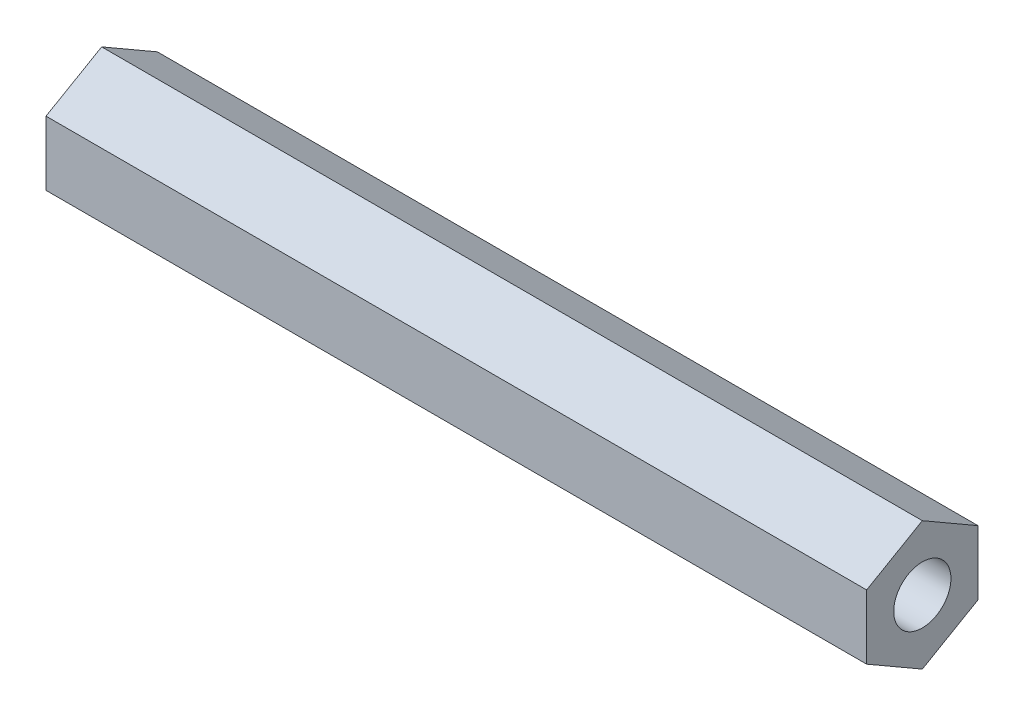
ISO-10303-21;
HEADER;
FILE_DESCRIPTION(('STEP AP214'),'2;1');
FILE_NAME('part.step','',(''),(''),'','','');
FILE_SCHEMA(('AUTOMOTIVE_DESIGN { 1 0 10303 214 1 1 1 1 }'));
ENDSEC;
DATA;
#1=APPLICATION_CONTEXT('core data for automotive mechanical design processes');
#2=APPLICATION_PROTOCOL_DEFINITION('international standard','automotive_design',2000,#1);
#3=PRODUCT_CONTEXT('',#1,'mechanical');
#4=PRODUCT('Part','Part','',(#3));
#5=PRODUCT_RELATED_PRODUCT_CATEGORY('part','',(#4));
#6=PRODUCT_DEFINITION_FORMATION('','',#4);
#7=PRODUCT_DEFINITION_CONTEXT('part definition',#1,'design');
#8=PRODUCT_DEFINITION('design','',#6,#7);
#9=PRODUCT_DEFINITION_SHAPE('','',#8);
#10=(LENGTH_UNIT() NAMED_UNIT(*) SI_UNIT(.MILLI.,.METRE.));
#11=(NAMED_UNIT(*) PLANE_ANGLE_UNIT() SI_UNIT($,.RADIAN.));
#12=(NAMED_UNIT(*) SI_UNIT($,.STERADIAN.) SOLID_ANGLE_UNIT());
#13=UNCERTAINTY_MEASURE_WITH_UNIT(LENGTH_MEASURE(1.E-05),#10,'distance_accuracy_value','');
#14=(GEOMETRIC_REPRESENTATION_CONTEXT(3) GLOBAL_UNCERTAINTY_ASSIGNED_CONTEXT((#13)) GLOBAL_UNIT_ASSIGNED_CONTEXT((#10,
#11,#12)) REPRESENTATION_CONTEXT('',''));
#15=CARTESIAN_POINT('',(0.,0.,0.));
#16=DIRECTION('',(0.,0.,1.));
#17=DIRECTION('',(1.,0.,0.));
#18=AXIS2_PLACEMENT_3D('',#15,#16,#17);
#19=CARTESIAN_POINT('',(93.599,0.,0.));
#20=DIRECTION('',(1.,0.,0.));
#21=DIRECTION('',(0.,0.,-1.));
#22=AXIS2_PLACEMENT_3D('',#19,#20,#21);
#23=PLANE('',#22);
#24=DIRECTION('',(0.,0.499999999999995,0.866025403784442));
#25=VECTOR('',#24,1.);
#26=CARTESIAN_POINT('',(93.599,3.66617420935419,-6.34999999999995));
#27=LINE('',#26,#25);
#28=CARTESIAN_POINT('',(93.599,3.66617420935419,-6.34999999999995));
#29=VERTEX_POINT('',#28);
#30=CARTESIAN_POINT('',(93.599,7.33234841870824,0.));
#31=VERTEX_POINT('',#30);
#32=EDGE_CURVE('E146',#29,#31,#27,.T.);
#33=ORIENTED_EDGE('',*,*,#32,.T.);
#34=DIRECTION('',(0.,-0.500000000000001,0.866025403784438));
#35=VECTOR('',#34,1.);
#36=CARTESIAN_POINT('',(93.599,7.33234841870824,0.));
#37=LINE('',#36,#35);
#38=CARTESIAN_POINT('',(93.599,3.6661742093541,6.35));
#39=VERTEX_POINT('',#38);
#40=EDGE_CURVE('E94',#31,#39,#37,.T.);
#41=ORIENTED_EDGE('',*,*,#40,.T.);
#42=DIRECTION('',(0.,-1.,0.));
#43=VECTOR('',#42,1.);
#44=CARTESIAN_POINT('',(93.599,3.6661742093541,6.35));
#45=LINE('',#44,#43);
#46=CARTESIAN_POINT('',(93.599,-3.66617420935415,6.34999999999997));
#47=VERTEX_POINT('',#46);
#48=EDGE_CURVE('E107',#39,#47,#45,.T.);
#49=ORIENTED_EDGE('',*,*,#48,.T.);
#50=DIRECTION('',(0.,-0.499999999999995,-0.866025403784442));
#51=VECTOR('',#50,1.);
#52=CARTESIAN_POINT('',(93.599,-3.66617420935415,6.34999999999997));
#53=LINE('',#52,#51);
#54=CARTESIAN_POINT('',(93.599,-7.33234841870824,0.));
#55=VERTEX_POINT('',#54);
#56=EDGE_CURVE('E101',#47,#55,#53,.T.);
#57=ORIENTED_EDGE('',*,*,#56,.T.);
#58=DIRECTION('',(0.,0.500000000000007,-0.866025403784435));
#59=VECTOR('',#58,1.);
#60=CARTESIAN_POINT('',(93.599,-7.33234841870824,0.));
#61=LINE('',#60,#59);
#62=CARTESIAN_POINT('',(93.599,-3.66617420935406,-6.35000000000002));
#63=VERTEX_POINT('',#62);
#64=EDGE_CURVE('E105',#55,#63,#61,.T.);
#65=ORIENTED_EDGE('',*,*,#64,.T.);
#66=DIRECTION('',(0.,1.,0.));
#67=VECTOR('',#66,1.);
#68=CARTESIAN_POINT('',(93.599,-3.66617420935406,-6.35000000000002));
#69=LINE('',#68,#67);
#70=EDGE_CURVE('E57',#63,#29,#69,.T.);
#71=ORIENTED_EDGE('',*,*,#70,.T.);
#72=EDGE_LOOP('',(#33,#41,#49,#57,#65,#71));
#73=FACE_BOUND('',#72,.T.);
#74=CARTESIAN_POINT('',(93.599,0.,0.));
#75=DIRECTION('',(1.,0.,0.));
#76=DIRECTION('',(0.,0.,-1.));
#77=AXIS2_PLACEMENT_3D('',#74,#75,#76);
#78=CIRCLE('',#77,3.2639);
#79=CARTESIAN_POINT('',(93.599,0.,-3.2639));
#80=VERTEX_POINT('',#79);
#81=EDGE_CURVE('E134',#80,#80,#78,.T.);
#82=ORIENTED_EDGE('',*,*,#81,.F.);
#83=EDGE_LOOP('',(#82));
#84=FACE_BOUND('',#83,.T.);
#85=ADVANCED_FACE('F39',(#73,#84),#23,.T.);
#86=CARTESIAN_POINT('',(0.,0.,0.));
#87=DIRECTION('',(1.,0.,0.));
#88=DIRECTION('',(0.,0.,-1.));
#89=AXIS2_PLACEMENT_3D('',#86,#87,#88);
#90=PLANE('',#89);
#91=DIRECTION('',(0.,0.499999999999995,0.866025403784442));
#92=VECTOR('',#91,1.);
#93=CARTESIAN_POINT('',(0.,3.66617420935419,-6.34999999999995));
#94=LINE('',#93,#92);
#95=CARTESIAN_POINT('',(0.,3.66617420935419,-6.34999999999995));
#96=VERTEX_POINT('',#95);
#97=CARTESIAN_POINT('',(0.,7.33234841870824,0.));
#98=VERTEX_POINT('',#97);
#99=EDGE_CURVE('E129',#96,#98,#94,.T.);
#100=ORIENTED_EDGE('',*,*,#99,.F.);
#101=DIRECTION('',(0.,1.,0.));
#102=VECTOR('',#101,1.);
#103=CARTESIAN_POINT('',(0.,-3.66617420935406,-6.35000000000002));
#104=LINE('',#103,#102);
#105=CARTESIAN_POINT('',(0.,-3.66617420935406,-6.35000000000002));
#106=VERTEX_POINT('',#105);
#107=EDGE_CURVE('E86',#106,#96,#104,.T.);
#108=ORIENTED_EDGE('',*,*,#107,.F.);
#109=DIRECTION('',(0.,0.500000000000007,-0.866025403784435));
#110=VECTOR('',#109,1.);
#111=CARTESIAN_POINT('',(0.,-7.33234841870824,0.));
#112=LINE('',#111,#110);
#113=CARTESIAN_POINT('',(0.,-7.33234841870824,0.));
#114=VERTEX_POINT('',#113);
#115=EDGE_CURVE('E80',#114,#106,#112,.T.);
#116=ORIENTED_EDGE('',*,*,#115,.F.);
#117=DIRECTION('',(0.,-0.499999999999995,-0.866025403784442));
#118=VECTOR('',#117,1.);
#119=CARTESIAN_POINT('',(0.,-3.66617420935415,6.34999999999997));
#120=LINE('',#119,#118);
#121=CARTESIAN_POINT('',(0.,-3.66617420935415,6.34999999999997));
#122=VERTEX_POINT('',#121);
#123=EDGE_CURVE('E116',#122,#114,#120,.T.);
#124=ORIENTED_EDGE('',*,*,#123,.F.);
#125=DIRECTION('',(0.,-1.,0.));
#126=VECTOR('',#125,1.);
#127=CARTESIAN_POINT('',(0.,3.6661742093541,6.35));
#128=LINE('',#127,#126);
#129=CARTESIAN_POINT('',(0.,3.6661742093541,6.35));
#130=VERTEX_POINT('',#129);
#131=EDGE_CURVE('E137',#130,#122,#128,.T.);
#132=ORIENTED_EDGE('',*,*,#131,.F.);
#133=DIRECTION('',(0.,-0.500000000000001,0.866025403784438));
#134=VECTOR('',#133,1.);
#135=CARTESIAN_POINT('',(0.,7.33234841870824,0.));
#136=LINE('',#135,#134);
#137=EDGE_CURVE('E133',#98,#130,#136,.T.);
#138=ORIENTED_EDGE('',*,*,#137,.F.);
#139=EDGE_LOOP('',(#100,#108,#116,#124,#132,#138));
#140=FACE_BOUND('',#139,.T.);
#141=CARTESIAN_POINT('',(0.,0.,0.));
#142=DIRECTION('',(1.,0.,0.));
#143=DIRECTION('',(0.,0.,-1.));
#144=AXIS2_PLACEMENT_3D('',#141,#142,#143);
#145=CIRCLE('',#144,3.2639);
#146=CARTESIAN_POINT('',(0.,0.,-3.2639));
#147=VERTEX_POINT('',#146);
#148=EDGE_CURVE('E243',#147,#147,#145,.T.);
#149=ORIENTED_EDGE('',*,*,#148,.T.);
#150=EDGE_LOOP('',(#149));
#151=FACE_BOUND('',#150,.T.);
#152=ADVANCED_FACE('F159',(#140,#151),#90,.F.);
#153=CARTESIAN_POINT('',(93.599,3.66617420935419,-6.34999999999995));
#154=DIRECTION('',(0.,-0.866025403784442,0.499999999999995));
#155=DIRECTION('',(0.,-0.499999999999995,-0.866025403784442));
#156=AXIS2_PLACEMENT_3D('',#153,#154,#155);
#157=PLANE('',#156);
#158=ORIENTED_EDGE('',*,*,#99,.T.);
#159=DIRECTION('',(-1.,0.,0.));
#160=VECTOR('',#159,1.);
#161=CARTESIAN_POINT('',(93.599,7.33234841870824,0.));
#162=LINE('',#161,#160);
#163=EDGE_CURVE('E11',#31,#98,#162,.T.);
#164=ORIENTED_EDGE('',*,*,#163,.F.);
#165=ORIENTED_EDGE('',*,*,#32,.F.);
#166=DIRECTION('',(-1.,0.,0.));
#167=VECTOR('',#166,1.);
#168=CARTESIAN_POINT('',(93.599,3.66617420935419,-6.34999999999995));
#169=LINE('',#168,#167);
#170=EDGE_CURVE('E125',#29,#96,#169,.T.);
#171=ORIENTED_EDGE('',*,*,#170,.T.);
#172=EDGE_LOOP('',(#158,#164,#165,#171));
#173=FACE_BOUND('',#172,.T.);
#174=ADVANCED_FACE('F41',(#173),#157,.F.);
#175=CARTESIAN_POINT('',(93.599,7.33234841870824,0.));
#176=DIRECTION('',(0.,-0.866025403784438,-0.500000000000001));
#177=DIRECTION('',(0.,0.500000000000001,-0.866025403784438));
#178=AXIS2_PLACEMENT_3D('',#175,#176,#177);
#179=PLANE('',#178);
#180=ORIENTED_EDGE('',*,*,#137,.T.);
#181=DIRECTION('',(-1.,0.,0.));
#182=VECTOR('',#181,1.);
#183=CARTESIAN_POINT('',(93.599,3.6661742093541,6.35));
#184=LINE('',#183,#182);
#185=EDGE_CURVE('E49',#39,#130,#184,.T.);
#186=ORIENTED_EDGE('',*,*,#185,.F.);
#187=ORIENTED_EDGE('',*,*,#40,.F.);
#188=ORIENTED_EDGE('',*,*,#163,.T.);
#189=EDGE_LOOP('',(#180,#186,#187,#188));
#190=FACE_BOUND('',#189,.T.);
#191=ADVANCED_FACE('F184',(#190),#179,.F.);
#192=CARTESIAN_POINT('',(93.599,3.6661742093541,6.35));
#193=DIRECTION('',(0.,0.,-1.));
#194=DIRECTION('',(0.,1.,0.));
#195=AXIS2_PLACEMENT_3D('',#192,#193,#194);
#196=PLANE('',#195);
#197=ORIENTED_EDGE('',*,*,#131,.T.);
#198=DIRECTION('',(-1.,0.,0.));
#199=VECTOR('',#198,1.);
#200=CARTESIAN_POINT('',(93.599,-3.66617420935415,6.34999999999997));
#201=LINE('',#200,#199);
#202=EDGE_CURVE('E118',#47,#122,#201,.T.);
#203=ORIENTED_EDGE('',*,*,#202,.F.);
#204=ORIENTED_EDGE('',*,*,#48,.F.);
#205=ORIENTED_EDGE('',*,*,#185,.T.);
#206=EDGE_LOOP('',(#197,#203,#204,#205));
#207=FACE_BOUND('',#206,.T.);
#208=ADVANCED_FACE('F156',(#207),#196,.F.);
#209=CARTESIAN_POINT('',(93.599,-3.66617420935415,6.34999999999997));
#210=DIRECTION('',(0.,0.866025403784442,-0.499999999999995));
#211=DIRECTION('',(0.,0.499999999999995,0.866025403784442));
#212=AXIS2_PLACEMENT_3D('',#209,#210,#211);
#213=PLANE('',#212);
#214=ORIENTED_EDGE('',*,*,#123,.T.);
#215=DIRECTION('',(-1.,0.,0.));
#216=VECTOR('',#215,1.);
#217=CARTESIAN_POINT('',(93.599,-7.33234841870824,0.));
#218=LINE('',#217,#216);
#219=EDGE_CURVE('E113',#55,#114,#218,.T.);
#220=ORIENTED_EDGE('',*,*,#219,.F.);
#221=ORIENTED_EDGE('',*,*,#56,.F.);
#222=ORIENTED_EDGE('',*,*,#202,.T.);
#223=EDGE_LOOP('',(#214,#220,#221,#222));
#224=FACE_BOUND('',#223,.T.);
#225=ADVANCED_FACE('F114',(#224),#213,.F.);
#226=CARTESIAN_POINT('',(93.599,-7.33234841870824,0.));
#227=DIRECTION('',(0.,0.866025403784435,0.500000000000007));
#228=DIRECTION('',(0.,-0.500000000000007,0.866025403784435));
#229=AXIS2_PLACEMENT_3D('',#226,#227,#228);
#230=PLANE('',#229);
#231=ORIENTED_EDGE('',*,*,#115,.T.);
#232=DIRECTION('',(-1.,0.,0.));
#233=VECTOR('',#232,1.);
#234=CARTESIAN_POINT('',(93.599,-3.66617420935406,-6.35000000000002));
#235=LINE('',#234,#233);
#236=EDGE_CURVE('E119',#63,#106,#235,.T.);
#237=ORIENTED_EDGE('',*,*,#236,.F.);
#238=ORIENTED_EDGE('',*,*,#64,.F.);
#239=ORIENTED_EDGE('',*,*,#219,.T.);
#240=EDGE_LOOP('',(#231,#237,#238,#239));
#241=FACE_BOUND('',#240,.T.);
#242=ADVANCED_FACE('F121',(#241),#230,.F.);
#243=CARTESIAN_POINT('',(93.599,-3.66617420935406,-6.35000000000002));
#244=DIRECTION('',(0.,0.,1.));
#245=DIRECTION('',(0.,-1.,0.));
#246=AXIS2_PLACEMENT_3D('',#243,#244,#245);
#247=PLANE('',#246);
#248=ORIENTED_EDGE('',*,*,#107,.T.);
#249=ORIENTED_EDGE('',*,*,#170,.F.);
#250=ORIENTED_EDGE('',*,*,#70,.F.);
#251=ORIENTED_EDGE('',*,*,#236,.T.);
#252=EDGE_LOOP('',(#248,#249,#250,#251));
#253=FACE_BOUND('',#252,.T.);
#254=ADVANCED_FACE('F164',(#253),#247,.F.);
#255=CARTESIAN_POINT('',(93.599,0.,0.));
#256=DIRECTION('',(-1.,0.,0.));
#257=DIRECTION('',(0.,0.,1.));
#258=AXIS2_PLACEMENT_3D('',#255,#256,#257);
#259=CYLINDRICAL_SURFACE('',#258,3.2639);
#260=ORIENTED_EDGE('',*,*,#81,.T.);
#261=EDGE_LOOP('',(#260));
#262=FACE_BOUND('',#261,.T.);
#263=ORIENTED_EDGE('',*,*,#148,.F.);
#264=EDGE_LOOP('',(#263));
#265=FACE_BOUND('',#264,.T.);
#266=ADVANCED_FACE('F166',(#262,#265),#259,.F.);
#267=CLOSED_SHELL('',(#85,#152,#174,#191,#208,#225,#242,#254,#266));
#268=MANIFOLD_SOLID_BREP('B2',#267);
#269=ADVANCED_BREP_SHAPE_REPRESENTATION('',(#18,#268),#14);
#270=SHAPE_DEFINITION_REPRESENTATION(#9,#269);
ENDSEC;
END-ISO-10303-21;
